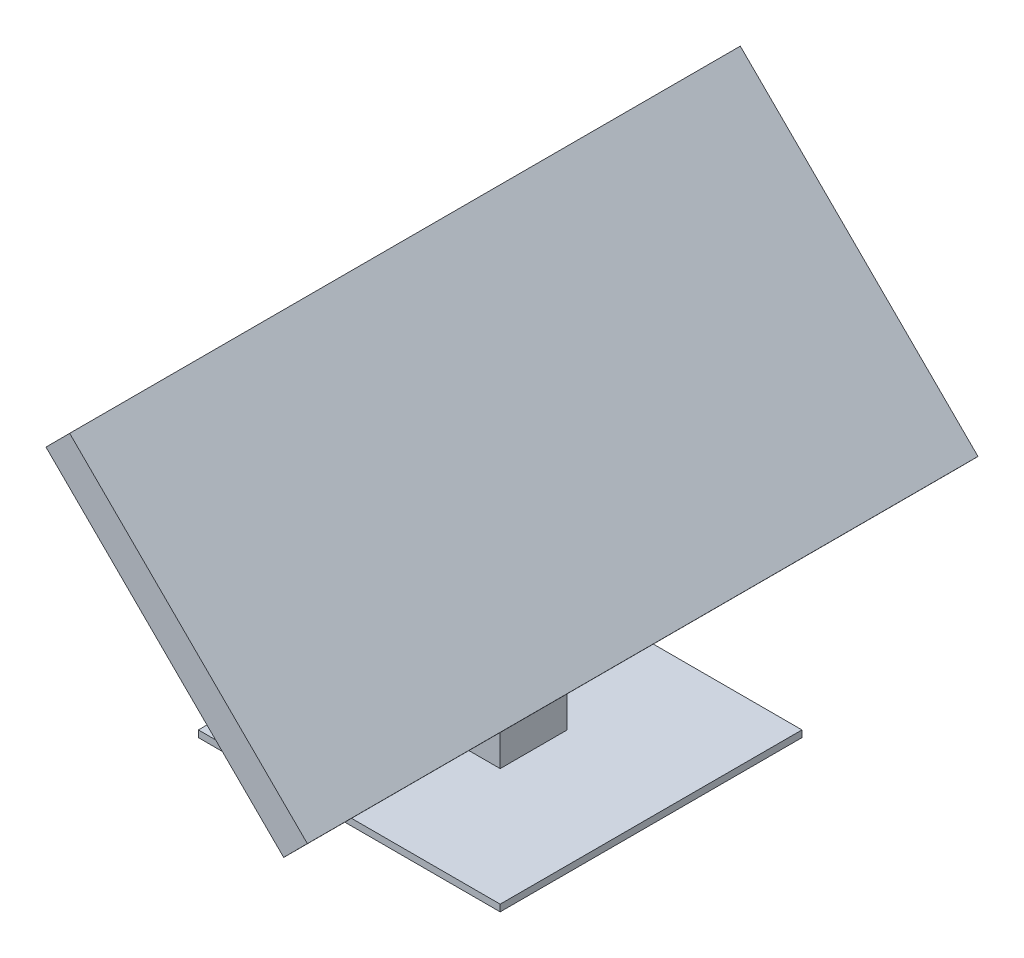
ISO-10303-21;
HEADER;
FILE_DESCRIPTION(('STEP AP214'),'2;1');
FILE_NAME('part.step','',(''),(''),'','','');
FILE_SCHEMA(('AUTOMOTIVE_DESIGN { 1 0 10303 214 1 1 1 1 }'));
ENDSEC;
DATA;
#1=APPLICATION_CONTEXT('core data for automotive mechanical design processes');
#2=APPLICATION_PROTOCOL_DEFINITION('international standard','automotive_design',2000,#1);
#3=PRODUCT_CONTEXT('',#1,'mechanical');
#4=PRODUCT('Part','Part','',(#3));
#5=PRODUCT_RELATED_PRODUCT_CATEGORY('part','',(#4));
#6=PRODUCT_DEFINITION_FORMATION('','',#4);
#7=PRODUCT_DEFINITION_CONTEXT('part definition',#1,'design');
#8=PRODUCT_DEFINITION('design','',#6,#7);
#9=PRODUCT_DEFINITION_SHAPE('','',#8);
#10=(LENGTH_UNIT() NAMED_UNIT(*) SI_UNIT(.MILLI.,.METRE.));
#11=(NAMED_UNIT(*) PLANE_ANGLE_UNIT() SI_UNIT($,.RADIAN.));
#12=(NAMED_UNIT(*) SI_UNIT($,.STERADIAN.) SOLID_ANGLE_UNIT());
#13=UNCERTAINTY_MEASURE_WITH_UNIT(LENGTH_MEASURE(1.E-05),#10,'distance_accuracy_value','');
#14=(GEOMETRIC_REPRESENTATION_CONTEXT(3) GLOBAL_UNCERTAINTY_ASSIGNED_CONTEXT((#13)) GLOBAL_UNIT_ASSIGNED_CONTEXT((#10,
#11,#12)) REPRESENTATION_CONTEXT('',''));
#15=CARTESIAN_POINT('',(0.,0.,0.));
#16=DIRECTION('',(0.,0.,1.));
#17=DIRECTION('',(1.,0.,0.));
#18=AXIS2_PLACEMENT_3D('',#15,#16,#17);
#19=CARTESIAN_POINT('',(0.,1.,0.));
#20=DIRECTION('',(0.,-1.,0.));
#21=DIRECTION('',(0.,0.,-1.));
#22=AXIS2_PLACEMENT_3D('',#19,#20,#21);
#23=PLANE('',#22);
#24=DIRECTION('',(0.,0.,1.));
#25=VECTOR('',#24,1.);
#26=CARTESIAN_POINT('',(0.,1.,0.));
#27=LINE('',#26,#25);
#28=CARTESIAN_POINT('',(0.,1.,-45.));
#29=VERTEX_POINT('',#28);
#30=CARTESIAN_POINT('',(0.,1.,0.));
#31=VERTEX_POINT('',#30);
#32=EDGE_CURVE('E183',#29,#31,#27,.T.);
#33=ORIENTED_EDGE('',*,*,#32,.T.);
#34=DIRECTION('',(1.,0.,0.));
#35=VECTOR('',#34,1.);
#36=CARTESIAN_POINT('',(0.,1.,0.));
#37=LINE('',#36,#35);
#38=CARTESIAN_POINT('',(45.,1.,0.));
#39=VERTEX_POINT('',#38);
#40=EDGE_CURVE('E186',#31,#39,#37,.T.);
#41=ORIENTED_EDGE('',*,*,#40,.T.);
#42=DIRECTION('',(0.,0.,-1.));
#43=VECTOR('',#42,1.);
#44=CARTESIAN_POINT('',(45.,1.,0.));
#45=LINE('',#44,#43);
#46=CARTESIAN_POINT('',(45.,1.,-45.));
#47=VERTEX_POINT('',#46);
#48=EDGE_CURVE('E189',#39,#47,#45,.T.);
#49=ORIENTED_EDGE('',*,*,#48,.T.);
#50=DIRECTION('',(-1.,0.,0.));
#51=VECTOR('',#50,1.);
#52=CARTESIAN_POINT('',(0.,1.,-45.));
#53=LINE('',#52,#51);
#54=EDGE_CURVE('E191',#47,#29,#53,.T.);
#55=ORIENTED_EDGE('',*,*,#54,.T.);
#56=EDGE_LOOP('',(#33,#41,#49,#55));
#57=FACE_BOUND('',#56,.T.);
#58=DIRECTION('',(0.,0.,1.));
#59=VECTOR('',#58,1.);
#60=CARTESIAN_POINT('',(17.5,1.,-27.5));
#61=LINE('',#60,#59);
#62=CARTESIAN_POINT('',(17.5,1.,-27.5));
#63=VERTEX_POINT('',#62);
#64=CARTESIAN_POINT('',(17.5,1.,-17.5));
#65=VERTEX_POINT('',#64);
#66=EDGE_CURVE('E49',#63,#65,#61,.T.);
#67=ORIENTED_EDGE('',*,*,#66,.F.);
#68=DIRECTION('',(1.,0.,0.));
#69=VECTOR('',#68,1.);
#70=CARTESIAN_POINT('',(17.5,1.,-27.5));
#71=LINE('',#70,#69);
#72=CARTESIAN_POINT('',(27.5,1.,-27.5));
#73=VERTEX_POINT('',#72);
#74=EDGE_CURVE('E166',#63,#73,#71,.T.);
#75=ORIENTED_EDGE('',*,*,#74,.T.);
#76=DIRECTION('',(0.,0.,1.));
#77=VECTOR('',#76,1.);
#78=CARTESIAN_POINT('',(27.5,1.,-27.5));
#79=LINE('',#78,#77);
#80=CARTESIAN_POINT('',(27.5,1.,-17.5));
#81=VERTEX_POINT('',#80);
#82=EDGE_CURVE('E171',#73,#81,#79,.T.);
#83=ORIENTED_EDGE('',*,*,#82,.T.);
#84=DIRECTION('',(1.,0.,0.));
#85=VECTOR('',#84,1.);
#86=CARTESIAN_POINT('',(17.5,1.,-17.5));
#87=LINE('',#86,#85);
#88=EDGE_CURVE('E168',#65,#81,#87,.T.);
#89=ORIENTED_EDGE('',*,*,#88,.F.);
#90=EDGE_LOOP('',(#67,#75,#83,#89));
#91=FACE_BOUND('',#90,.T.);
#92=ADVANCED_FACE('F34',(#57,#91),#23,.F.);
#93=CARTESIAN_POINT('',(0.,1.,0.));
#94=DIRECTION('',(1.,0.,0.));
#95=DIRECTION('',(0.,0.,-1.));
#96=AXIS2_PLACEMENT_3D('',#93,#94,#95);
#97=PLANE('',#96);
#98=DIRECTION('',(0.,0.,1.));
#99=VECTOR('',#98,1.);
#100=CARTESIAN_POINT('',(0.,0.,0.));
#101=LINE('',#100,#99);
#102=CARTESIAN_POINT('',(0.,0.,-45.));
#103=VERTEX_POINT('',#102);
#104=CARTESIAN_POINT('',(0.,0.,0.));
#105=VERTEX_POINT('',#104);
#106=EDGE_CURVE('E182',#103,#105,#101,.T.);
#107=ORIENTED_EDGE('',*,*,#106,.T.);
#108=DIRECTION('',(0.,-1.,0.));
#109=VECTOR('',#108,1.);
#110=CARTESIAN_POINT('',(0.,1.,0.));
#111=LINE('',#110,#109);
#112=EDGE_CURVE('E11',#31,#105,#111,.T.);
#113=ORIENTED_EDGE('',*,*,#112,.F.);
#114=ORIENTED_EDGE('',*,*,#32,.F.);
#115=DIRECTION('',(0.,-1.,0.));
#116=VECTOR('',#115,1.);
#117=CARTESIAN_POINT('',(0.,1.,-45.));
#118=LINE('',#117,#116);
#119=EDGE_CURVE('E193',#29,#103,#118,.T.);
#120=ORIENTED_EDGE('',*,*,#119,.T.);
#121=EDGE_LOOP('',(#107,#113,#114,#120));
#122=FACE_BOUND('',#121,.T.);
#123=ADVANCED_FACE('F36',(#122),#97,.F.);
#124=CARTESIAN_POINT('',(0.,1.,0.));
#125=DIRECTION('',(0.,0.,-1.));
#126=DIRECTION('',(-1.,0.,0.));
#127=AXIS2_PLACEMENT_3D('',#124,#125,#126);
#128=PLANE('',#127);
#129=DIRECTION('',(1.,0.,0.));
#130=VECTOR('',#129,1.);
#131=CARTESIAN_POINT('',(0.,0.,0.));
#132=LINE('',#131,#130);
#133=CARTESIAN_POINT('',(45.,0.,0.));
#134=VERTEX_POINT('',#133);
#135=EDGE_CURVE('E196',#105,#134,#132,.T.);
#136=ORIENTED_EDGE('',*,*,#135,.T.);
#137=DIRECTION('',(0.,-1.,0.));
#138=VECTOR('',#137,1.);
#139=CARTESIAN_POINT('',(45.,1.,0.));
#140=LINE('',#139,#138);
#141=EDGE_CURVE('E42',#39,#134,#140,.T.);
#142=ORIENTED_EDGE('',*,*,#141,.F.);
#143=ORIENTED_EDGE('',*,*,#40,.F.);
#144=ORIENTED_EDGE('',*,*,#112,.T.);
#145=EDGE_LOOP('',(#136,#142,#143,#144));
#146=FACE_BOUND('',#145,.T.);
#147=ADVANCED_FACE('F225',(#146),#128,.F.);
#148=CARTESIAN_POINT('',(45.,1.,0.));
#149=DIRECTION('',(-1.,0.,0.));
#150=DIRECTION('',(0.,0.,1.));
#151=AXIS2_PLACEMENT_3D('',#148,#149,#150);
#152=PLANE('',#151);
#153=DIRECTION('',(0.,0.,-1.));
#154=VECTOR('',#153,1.);
#155=CARTESIAN_POINT('',(45.,0.,0.));
#156=LINE('',#155,#154);
#157=CARTESIAN_POINT('',(45.,0.,-45.));
#158=VERTEX_POINT('',#157);
#159=EDGE_CURVE('E198',#134,#158,#156,.T.);
#160=ORIENTED_EDGE('',*,*,#159,.T.);
#161=DIRECTION('',(0.,-1.,0.));
#162=VECTOR('',#161,1.);
#163=CARTESIAN_POINT('',(45.,1.,-45.));
#164=LINE('',#163,#162);
#165=EDGE_CURVE('E203',#47,#158,#164,.T.);
#166=ORIENTED_EDGE('',*,*,#165,.F.);
#167=ORIENTED_EDGE('',*,*,#48,.F.);
#168=ORIENTED_EDGE('',*,*,#141,.T.);
#169=EDGE_LOOP('',(#160,#166,#167,#168));
#170=FACE_BOUND('',#169,.T.);
#171=ADVANCED_FACE('F210',(#170),#152,.F.);
#172=CARTESIAN_POINT('',(0.,1.,-45.));
#173=DIRECTION('',(0.,0.,1.));
#174=DIRECTION('',(1.,0.,0.));
#175=AXIS2_PLACEMENT_3D('',#172,#173,#174);
#176=PLANE('',#175);
#177=DIRECTION('',(-1.,0.,0.));
#178=VECTOR('',#177,1.);
#179=CARTESIAN_POINT('',(0.,0.,-45.));
#180=LINE('',#179,#178);
#181=EDGE_CURVE('E187',#158,#103,#180,.T.);
#182=ORIENTED_EDGE('',*,*,#181,.T.);
#183=ORIENTED_EDGE('',*,*,#119,.F.);
#184=ORIENTED_EDGE('',*,*,#54,.F.);
#185=ORIENTED_EDGE('',*,*,#165,.T.);
#186=EDGE_LOOP('',(#182,#183,#184,#185));
#187=FACE_BOUND('',#186,.T.);
#188=ADVANCED_FACE('F219',(#187),#176,.F.);
#189=CARTESIAN_POINT('',(0.,0.,0.));
#190=DIRECTION('',(0.,-1.,0.));
#191=DIRECTION('',(0.,0.,-1.));
#192=AXIS2_PLACEMENT_3D('',#189,#190,#191);
#193=PLANE('',#192);
#194=ORIENTED_EDGE('',*,*,#106,.F.);
#195=ORIENTED_EDGE('',*,*,#181,.F.);
#196=ORIENTED_EDGE('',*,*,#159,.F.);
#197=ORIENTED_EDGE('',*,*,#135,.F.);
#198=EDGE_LOOP('',(#194,#195,#196,#197));
#199=FACE_BOUND('',#198,.T.);
#200=ADVANCED_FACE('F216',(#199),#193,.T.);
#201=CARTESIAN_POINT('',(17.5,41.,-27.5));
#202=DIRECTION('',(1.,0.,0.));
#203=DIRECTION('',(0.,0.,-1.));
#204=AXIS2_PLACEMENT_3D('',#201,#202,#203);
#205=PLANE('',#204);
#206=ORIENTED_EDGE('',*,*,#66,.T.);
#207=DIRECTION('',(0.,-1.,0.));
#208=VECTOR('',#207,1.);
#209=CARTESIAN_POINT('',(17.5,41.,-17.5));
#210=LINE('',#209,#208);
#211=CARTESIAN_POINT('',(17.5,41.,-17.5));
#212=VERTEX_POINT('',#211);
#213=EDGE_CURVE('E179',#212,#65,#210,.T.);
#214=ORIENTED_EDGE('',*,*,#213,.F.);
#215=DIRECTION('',(0.,0.,1.));
#216=VECTOR('',#215,1.);
#217=CARTESIAN_POINT('',(17.5,41.,-27.5));
#218=LINE('',#217,#216);
#219=CARTESIAN_POINT('',(17.5,41.,-27.5));
#220=VERTEX_POINT('',#219);
#221=EDGE_CURVE('E162',#220,#212,#218,.T.);
#222=ORIENTED_EDGE('',*,*,#221,.F.);
#223=DIRECTION('',(0.,-1.,0.));
#224=VECTOR('',#223,1.);
#225=CARTESIAN_POINT('',(17.5,41.,-27.5));
#226=LINE('',#225,#224);
#227=EDGE_CURVE('E165',#220,#63,#226,.T.);
#228=ORIENTED_EDGE('',*,*,#227,.T.);
#229=EDGE_LOOP('',(#206,#214,#222,#228));
#230=FACE_BOUND('',#229,.T.);
#231=ADVANCED_FACE('F238',(#230),#205,.F.);
#232=CARTESIAN_POINT('',(17.5,41.,-17.5));
#233=DIRECTION('',(0.,0.,-1.));
#234=DIRECTION('',(-1.,0.,0.));
#235=AXIS2_PLACEMENT_3D('',#232,#233,#234);
#236=PLANE('',#235);
#237=DIRECTION('',(0.,-1.,0.));
#238=VECTOR('',#237,1.);
#239=CARTESIAN_POINT('',(27.5,41.,-17.5));
#240=LINE('',#239,#238);
#241=CARTESIAN_POINT('',(27.5,31.0503512242188,-17.5));
#242=VERTEX_POINT('',#241);
#243=EDGE_CURVE('E177',#242,#81,#240,.T.);
#244=ORIENTED_EDGE('',*,*,#243,.F.);
#245=DIRECTION('',(0.70888920096489,-0.705319857054486,0.));
#246=VECTOR('',#245,1.);
#247=CARTESIAN_POINT('',(17.5,41.,-17.5));
#248=LINE('',#247,#246);
#249=EDGE_CURVE('E149',#212,#242,#248,.T.);
#250=ORIENTED_EDGE('',*,*,#249,.F.);
#251=ORIENTED_EDGE('',*,*,#213,.T.);
#252=ORIENTED_EDGE('',*,*,#88,.T.);
#253=EDGE_LOOP('',(#244,#250,#251,#252));
#254=FACE_BOUND('',#253,.T.);
#255=ADVANCED_FACE('F257',(#254),#236,.F.);
#256=CARTESIAN_POINT('',(27.5,41.,-27.5));
#257=DIRECTION('',(1.,0.,0.));
#258=DIRECTION('',(0.,0.,-1.));
#259=AXIS2_PLACEMENT_3D('',#256,#257,#258);
#260=PLANE('',#259);
#261=DIRECTION('',(0.,0.,1.));
#262=VECTOR('',#261,1.);
#263=CARTESIAN_POINT('',(27.5,31.0503512242188,-47.5));
#264=LINE('',#263,#262);
#265=CARTESIAN_POINT('',(27.5,31.0503512242188,-27.5));
#266=VERTEX_POINT('',#265);
#267=EDGE_CURVE('E152',#266,#242,#264,.T.);
#268=ORIENTED_EDGE('',*,*,#267,.T.);
#269=ORIENTED_EDGE('',*,*,#243,.T.);
#270=ORIENTED_EDGE('',*,*,#82,.F.);
#271=DIRECTION('',(0.,-1.,0.));
#272=VECTOR('',#271,1.);
#273=CARTESIAN_POINT('',(27.5,41.,-27.5));
#274=LINE('',#273,#272);
#275=EDGE_CURVE('E57',#266,#73,#274,.T.);
#276=ORIENTED_EDGE('',*,*,#275,.F.);
#277=EDGE_LOOP('',(#268,#269,#270,#276));
#278=FACE_BOUND('',#277,.T.);
#279=ADVANCED_FACE('F264',(#278),#260,.T.);
#280=CARTESIAN_POINT('',(17.5,41.,-27.5));
#281=DIRECTION('',(0.,0.,-1.));
#282=DIRECTION('',(-1.,0.,0.));
#283=AXIS2_PLACEMENT_3D('',#280,#281,#282);
#284=PLANE('',#283);
#285=DIRECTION('',(-0.70888920096489,0.705319857054486,0.));
#286=VECTOR('',#285,1.);
#287=CARTESIAN_POINT('',(17.5,41.,-27.5));
#288=LINE('',#287,#286);
#289=EDGE_CURVE('E159',#266,#220,#288,.T.);
#290=ORIENTED_EDGE('',*,*,#289,.F.);
#291=ORIENTED_EDGE('',*,*,#275,.T.);
#292=ORIENTED_EDGE('',*,*,#74,.F.);
#293=ORIENTED_EDGE('',*,*,#227,.F.);
#294=EDGE_LOOP('',(#290,#291,#292,#293));
#295=FACE_BOUND('',#294,.T.);
#296=ADVANCED_FACE('F271',(#295),#284,.T.);
#297=CARTESIAN_POINT('',(29.2055705887918,29.3533683921407,0.));
#298=DIRECTION('',(0.705319857054486,0.70888920096489,0.));
#299=DIRECTION('',(-0.70888920096489,0.705319857054486,0.));
#300=AXIS2_PLACEMENT_3D('',#297,#298,#299);
#301=PLANE('',#300);
#302=DIRECTION('',(0.,0.,-1.));
#303=VECTOR('',#302,1.);
#304=CARTESIAN_POINT('',(40.2222300241222,18.3921791857473,27.5));
#305=LINE('',#304,#303);
#306=CARTESIAN_POINT('',(40.2222300241222,18.3921791857473,27.5));
#307=VERTEX_POINT('',#306);
#308=CARTESIAN_POINT('',(40.2222300241222,18.3921791857473,-72.5));
#309=VERTEX_POINT('',#308);
#310=EDGE_CURVE('E148',#307,#309,#305,.T.);
#311=ORIENTED_EDGE('',*,*,#310,.F.);
#312=DIRECTION('',(-0.70888920096489,0.705319857054486,0.));
#313=VECTOR('',#312,1.);
#314=CARTESIAN_POINT('',(40.2222300241222,18.3921791857473,27.5));
#315=LINE('',#314,#313);
#316=CARTESIAN_POINT('',(4.77776997587775,53.6581720384715,27.5));
#317=VERTEX_POINT('',#316);
#318=EDGE_CURVE('E144',#307,#317,#315,.T.);
#319=ORIENTED_EDGE('',*,*,#318,.T.);
#320=DIRECTION('',(0.,0.,-1.));
#321=VECTOR('',#320,1.);
#322=CARTESIAN_POINT('',(4.77776997587775,53.6581720384715,27.5));
#323=LINE('',#322,#321);
#324=CARTESIAN_POINT('',(4.77776997587775,53.6581720384715,-72.5));
#325=VERTEX_POINT('',#324);
#326=EDGE_CURVE('E370',#317,#325,#323,.T.);
#327=ORIENTED_EDGE('',*,*,#326,.T.);
#328=DIRECTION('',(-0.70888920096489,0.705319857054486,0.));
#329=VECTOR('',#328,1.);
#330=CARTESIAN_POINT('',(40.2222300241222,18.3921791857473,-72.5));
#331=LINE('',#330,#329);
#332=EDGE_CURVE('E372',#309,#325,#331,.T.);
#333=ORIENTED_EDGE('',*,*,#332,.F.);
#334=EDGE_LOOP('',(#311,#319,#327,#333));
#335=FACE_BOUND('',#334,.T.);
#336=ORIENTED_EDGE('',*,*,#289,.T.);
#337=ORIENTED_EDGE('',*,*,#221,.T.);
#338=ORIENTED_EDGE('',*,*,#249,.T.);
#339=ORIENTED_EDGE('',*,*,#267,.F.);
#340=EDGE_LOOP('',(#336,#337,#338,#339));
#341=FACE_BOUND('',#340,.T.);
#342=ADVANCED_FACE('F279',(#335,#341),#301,.F.);
#343=CARTESIAN_POINT('',(43.7488293093947,21.9366251905717,27.5));
#344=DIRECTION('',(-0.70888920096489,0.705319857054486,0.));
#345=DIRECTION('',(-0.705319857054486,-0.70888920096489,0.));
#346=AXIS2_PLACEMENT_3D('',#343,#344,#345);
#347=PLANE('',#346);
#348=ORIENTED_EDGE('',*,*,#310,.T.);
#349=DIRECTION('',(-0.705319857054486,-0.70888920096489,0.));
#350=VECTOR('',#349,1.);
#351=CARTESIAN_POINT('',(43.7488293093947,21.9366251905717,-72.5));
#352=LINE('',#351,#350);
#353=CARTESIAN_POINT('',(43.7488293093947,21.9366251905717,-72.5));
#354=VERTEX_POINT('',#353);
#355=EDGE_CURVE('E129',#354,#309,#352,.T.);
#356=ORIENTED_EDGE('',*,*,#355,.F.);
#357=DIRECTION('',(0.,0.,-1.));
#358=VECTOR('',#357,1.);
#359=CARTESIAN_POINT('',(43.7488293093947,21.9366251905717,27.5));
#360=LINE('',#359,#358);
#361=CARTESIAN_POINT('',(43.7488293093947,21.9366251905717,27.5));
#362=VERTEX_POINT('',#361);
#363=EDGE_CURVE('E136',#362,#354,#360,.T.);
#364=ORIENTED_EDGE('',*,*,#363,.F.);
#365=DIRECTION('',(-0.705319857054486,-0.70888920096489,0.));
#366=VECTOR('',#365,1.);
#367=CARTESIAN_POINT('',(43.7488293093947,21.9366251905717,27.5));
#368=LINE('',#367,#366);
#369=EDGE_CURVE('E367',#362,#307,#368,.T.);
#370=ORIENTED_EDGE('',*,*,#369,.T.);
#371=EDGE_LOOP('',(#348,#356,#364,#370));
#372=FACE_BOUND('',#371,.T.);
#373=ADVANCED_FACE('F146',(#372),#347,.F.);
#374=CARTESIAN_POINT('',(43.7488293093947,21.9366251905717,-72.5));
#375=DIRECTION('',(0.,0.,1.));
#376=DIRECTION('',(1.,0.,0.));
#377=AXIS2_PLACEMENT_3D('',#374,#375,#376);
#378=PLANE('',#377);
#379=ORIENTED_EDGE('',*,*,#332,.T.);
#380=DIRECTION('',(-0.705319857054486,-0.70888920096489,0.));
#381=VECTOR('',#380,1.);
#382=CARTESIAN_POINT('',(8.30436926115018,57.202618043296,-72.5));
#383=LINE('',#382,#381);
#384=CARTESIAN_POINT('',(8.30436926115018,57.202618043296,-72.5));
#385=VERTEX_POINT('',#384);
#386=EDGE_CURVE('E131',#385,#325,#383,.T.);
#387=ORIENTED_EDGE('',*,*,#386,.F.);
#388=DIRECTION('',(-0.70888920096489,0.705319857054486,0.));
#389=VECTOR('',#388,1.);
#390=CARTESIAN_POINT('',(43.7488293093947,21.9366251905717,-72.5));
#391=LINE('',#390,#389);
#392=EDGE_CURVE('E124',#354,#385,#391,.T.);
#393=ORIENTED_EDGE('',*,*,#392,.F.);
#394=ORIENTED_EDGE('',*,*,#355,.T.);
#395=EDGE_LOOP('',(#379,#387,#393,#394));
#396=FACE_BOUND('',#395,.T.);
#397=ADVANCED_FACE('F127',(#396),#378,.F.);
#398=CARTESIAN_POINT('',(8.30436926115018,57.202618043296,27.5));
#399=DIRECTION('',(-0.70888920096489,0.705319857054486,0.));
#400=DIRECTION('',(-0.705319857054486,-0.70888920096489,0.));
#401=AXIS2_PLACEMENT_3D('',#398,#399,#400);
#402=PLANE('',#401);
#403=ORIENTED_EDGE('',*,*,#326,.F.);
#404=DIRECTION('',(-0.705319857054486,-0.70888920096489,0.));
#405=VECTOR('',#404,1.);
#406=CARTESIAN_POINT('',(8.30436926115018,57.202618043296,27.5));
#407=LINE('',#406,#405);
#408=CARTESIAN_POINT('',(8.30436926115018,57.202618043296,27.5));
#409=VERTEX_POINT('',#408);
#410=EDGE_CURVE('E154',#409,#317,#407,.T.);
#411=ORIENTED_EDGE('',*,*,#410,.F.);
#412=DIRECTION('',(0.,0.,-1.));
#413=VECTOR('',#412,1.);
#414=CARTESIAN_POINT('',(8.30436926115018,57.202618043296,27.5));
#415=LINE('',#414,#413);
#416=EDGE_CURVE('E135',#409,#385,#415,.T.);
#417=ORIENTED_EDGE('',*,*,#416,.T.);
#418=ORIENTED_EDGE('',*,*,#386,.T.);
#419=EDGE_LOOP('',(#403,#411,#417,#418));
#420=FACE_BOUND('',#419,.T.);
#421=ADVANCED_FACE('F299',(#420),#402,.T.);
#422=CARTESIAN_POINT('',(43.7488293093947,21.9366251905717,27.5));
#423=DIRECTION('',(0.,0.,1.));
#424=DIRECTION('',(1.,0.,0.));
#425=AXIS2_PLACEMENT_3D('',#422,#423,#424);
#426=PLANE('',#425);
#427=ORIENTED_EDGE('',*,*,#318,.F.);
#428=ORIENTED_EDGE('',*,*,#369,.F.);
#429=DIRECTION('',(-0.70888920096489,0.705319857054486,0.));
#430=VECTOR('',#429,1.);
#431=CARTESIAN_POINT('',(43.7488293093947,21.9366251905717,27.5));
#432=LINE('',#431,#430);
#433=EDGE_CURVE('E142',#362,#409,#432,.T.);
#434=ORIENTED_EDGE('',*,*,#433,.T.);
#435=ORIENTED_EDGE('',*,*,#410,.T.);
#436=EDGE_LOOP('',(#427,#428,#434,#435));
#437=FACE_BOUND('',#436,.T.);
#438=ADVANCED_FACE('F306',(#437),#426,.T.);
#439=CARTESIAN_POINT('',(32.7321698740642,32.8978143969651,0.));
#440=DIRECTION('',(0.705319857054486,0.70888920096489,0.));
#441=DIRECTION('',(-0.70888920096489,0.705319857054486,0.));
#442=AXIS2_PLACEMENT_3D('',#439,#440,#441);
#443=PLANE('',#442);
#444=ORIENTED_EDGE('',*,*,#363,.T.);
#445=ORIENTED_EDGE('',*,*,#392,.T.);
#446=ORIENTED_EDGE('',*,*,#416,.F.);
#447=ORIENTED_EDGE('',*,*,#433,.F.);
#448=EDGE_LOOP('',(#444,#445,#446,#447));
#449=FACE_BOUND('',#448,.T.);
#450=ADVANCED_FACE('F140',(#449),#443,.T.);
#451=CLOSED_SHELL('',(#92,#123,#147,#171,#188,#200,#231,#255,#279,#296,#342,#373,#397,#421,#438,#450));
#452=MANIFOLD_SOLID_BREP('B2',#451);
#453=ADVANCED_BREP_SHAPE_REPRESENTATION('',(#18,#452),#14);
#454=SHAPE_DEFINITION_REPRESENTATION(#9,#453);
ENDSEC;
END-ISO-10303-21;
